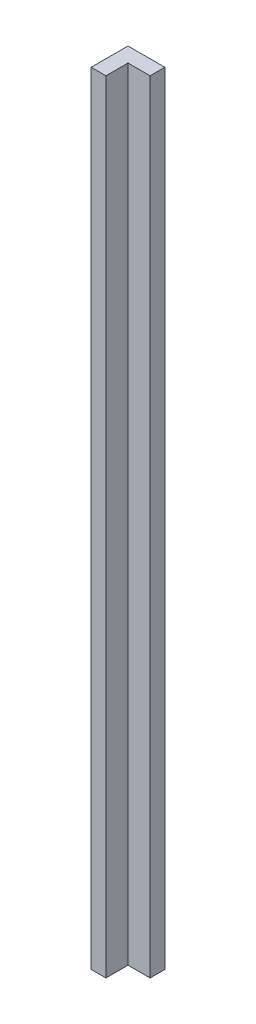
ISO-10303-21;
HEADER;
FILE_DESCRIPTION(('STEP AP214'),'2;1');
FILE_NAME('part.step','',(''),(''),'','','');
FILE_SCHEMA(('AUTOMOTIVE_DESIGN { 1 0 10303 214 1 1 1 1 }'));
ENDSEC;
DATA;
#1=APPLICATION_CONTEXT('core data for automotive mechanical design processes');
#2=APPLICATION_PROTOCOL_DEFINITION('international standard','automotive_design',2000,#1);
#3=PRODUCT_CONTEXT('',#1,'mechanical');
#4=PRODUCT('Part','Part','',(#3));
#5=PRODUCT_RELATED_PRODUCT_CATEGORY('part','',(#4));
#6=PRODUCT_DEFINITION_FORMATION('','',#4);
#7=PRODUCT_DEFINITION_CONTEXT('part definition',#1,'design');
#8=PRODUCT_DEFINITION('design','',#6,#7);
#9=PRODUCT_DEFINITION_SHAPE('','',#8);
#10=(LENGTH_UNIT() NAMED_UNIT(*) SI_UNIT(.MILLI.,.METRE.));
#11=(NAMED_UNIT(*) PLANE_ANGLE_UNIT() SI_UNIT($,.RADIAN.));
#12=(NAMED_UNIT(*) SI_UNIT($,.STERADIAN.) SOLID_ANGLE_UNIT());
#13=UNCERTAINTY_MEASURE_WITH_UNIT(LENGTH_MEASURE(1.E-05),#10,'distance_accuracy_value','');
#14=(GEOMETRIC_REPRESENTATION_CONTEXT(3) GLOBAL_UNCERTAINTY_ASSIGNED_CONTEXT((#13)) GLOBAL_UNIT_ASSIGNED_CONTEXT((#10,
#11,#12)) REPRESENTATION_CONTEXT('',''));
#15=CARTESIAN_POINT('',(0.,0.,0.));
#16=DIRECTION('',(0.,0.,1.));
#17=DIRECTION('',(1.,0.,0.));
#18=AXIS2_PLACEMENT_3D('',#15,#16,#17);
#19=CARTESIAN_POINT('',(-2.86150012018082,106.,3.29679835233847));
#20=DIRECTION('',(1.,0.,0.));
#21=DIRECTION('',(0.,0.,-1.));
#22=AXIS2_PLACEMENT_3D('',#19,#20,#21);
#23=PLANE('',#22);
#24=DIRECTION('',(0.,0.,1.));
#25=VECTOR('',#24,1.);
#26=CARTESIAN_POINT('',(-2.86150012018082,0.,3.29679835233847));
#27=LINE('',#26,#25);
#28=CARTESIAN_POINT('',(-2.86150012018082,0.,-1.70320164766153));
#29=VERTEX_POINT('',#28);
#30=CARTESIAN_POINT('',(-2.86150012018082,0.,3.29679835233847));
#31=VERTEX_POINT('',#30);
#32=EDGE_CURVE('E138',#29,#31,#27,.T.);
#33=ORIENTED_EDGE('',*,*,#32,.T.);
#34=DIRECTION('',(0.,-1.,0.));
#35=VECTOR('',#34,1.);
#36=CARTESIAN_POINT('',(-2.86150012018082,106.,3.29679835233847));
#37=LINE('',#36,#35);
#38=CARTESIAN_POINT('',(-2.86150012018082,106.,3.29679835233847));
#39=VERTEX_POINT('',#38);
#40=EDGE_CURVE('E54',#39,#31,#37,.T.);
#41=ORIENTED_EDGE('',*,*,#40,.F.);
#42=DIRECTION('',(0.,0.,1.));
#43=VECTOR('',#42,1.);
#44=CARTESIAN_POINT('',(-2.86150012018082,106.,3.29679835233847));
#45=LINE('',#44,#43);
#46=CARTESIAN_POINT('',(-2.86150012018082,106.,-1.70320164766153));
#47=VERTEX_POINT('',#46);
#48=EDGE_CURVE('E100',#47,#39,#45,.T.);
#49=ORIENTED_EDGE('',*,*,#48,.F.);
#50=DIRECTION('',(0.,-1.,0.));
#51=VECTOR('',#50,1.);
#52=CARTESIAN_POINT('',(-2.86150012018082,106.,-1.70320164766153));
#53=LINE('',#52,#51);
#54=EDGE_CURVE('E11',#47,#29,#53,.T.);
#55=ORIENTED_EDGE('',*,*,#54,.T.);
#56=EDGE_LOOP('',(#33,#41,#49,#55));
#57=FACE_BOUND('',#56,.T.);
#58=ADVANCED_FACE('F45',(#57),#23,.F.);
#59=CARTESIAN_POINT('',(-0.861500120180825,106.,3.29679835233847));
#60=DIRECTION('',(0.,0.,-1.));
#61=DIRECTION('',(-1.,0.,0.));
#62=AXIS2_PLACEMENT_3D('',#59,#60,#61);
#63=PLANE('',#62);
#64=DIRECTION('',(1.,0.,0.));
#65=VECTOR('',#64,1.);
#66=CARTESIAN_POINT('',(-0.861500120180825,0.,3.29679835233847));
#67=LINE('',#66,#65);
#68=CARTESIAN_POINT('',(-0.861500120180825,0.,3.29679835233847));
#69=VERTEX_POINT('',#68);
#70=EDGE_CURVE('E141',#31,#69,#67,.T.);
#71=ORIENTED_EDGE('',*,*,#70,.T.);
#72=DIRECTION('',(0.,-1.,0.));
#73=VECTOR('',#72,1.);
#74=CARTESIAN_POINT('',(-0.861500120180825,106.,3.29679835233847));
#75=LINE('',#74,#73);
#76=CARTESIAN_POINT('',(-0.861500120180825,106.,3.29679835233847));
#77=VERTEX_POINT('',#76);
#78=EDGE_CURVE('E125',#77,#69,#75,.T.);
#79=ORIENTED_EDGE('',*,*,#78,.F.);
#80=DIRECTION('',(1.,0.,0.));
#81=VECTOR('',#80,1.);
#82=CARTESIAN_POINT('',(-0.861500120180825,106.,3.29679835233847));
#83=LINE('',#82,#81);
#84=EDGE_CURVE('E114',#39,#77,#83,.T.);
#85=ORIENTED_EDGE('',*,*,#84,.F.);
#86=ORIENTED_EDGE('',*,*,#40,.T.);
#87=EDGE_LOOP('',(#71,#79,#85,#86));
#88=FACE_BOUND('',#87,.T.);
#89=ADVANCED_FACE('F162',(#88),#63,.F.);
#90=CARTESIAN_POINT('',(-0.861500120180825,106.,0.296798352338472));
#91=DIRECTION('',(-1.,0.,0.));
#92=DIRECTION('',(0.,0.,1.));
#93=AXIS2_PLACEMENT_3D('',#90,#91,#92);
#94=PLANE('',#93);
#95=DIRECTION('',(0.,0.,-1.));
#96=VECTOR('',#95,1.);
#97=CARTESIAN_POINT('',(-0.861500120180825,0.,0.296798352338472));
#98=LINE('',#97,#96);
#99=CARTESIAN_POINT('',(-0.861500120180825,0.,0.296798352338472));
#100=VERTEX_POINT('',#99);
#101=EDGE_CURVE('E123',#69,#100,#98,.T.);
#102=ORIENTED_EDGE('',*,*,#101,.T.);
#103=DIRECTION('',(0.,-1.,0.));
#104=VECTOR('',#103,1.);
#105=CARTESIAN_POINT('',(-0.861500120180825,106.,0.296798352338472));
#106=LINE('',#105,#104);
#107=CARTESIAN_POINT('',(-0.861500120180825,106.,0.296798352338472));
#108=VERTEX_POINT('',#107);
#109=EDGE_CURVE('E120',#108,#100,#106,.T.);
#110=ORIENTED_EDGE('',*,*,#109,.F.);
#111=DIRECTION('',(0.,0.,-1.));
#112=VECTOR('',#111,1.);
#113=CARTESIAN_POINT('',(-0.861500120180825,106.,0.296798352338472));
#114=LINE('',#113,#112);
#115=EDGE_CURVE('E108',#77,#108,#114,.T.);
#116=ORIENTED_EDGE('',*,*,#115,.F.);
#117=ORIENTED_EDGE('',*,*,#78,.T.);
#118=EDGE_LOOP('',(#102,#110,#116,#117));
#119=FACE_BOUND('',#118,.T.);
#120=ADVANCED_FACE('F121',(#119),#94,.F.);
#121=CARTESIAN_POINT('',(2.13849987981918,106.,0.296798352338471));
#122=DIRECTION('',(0.,0.,-1.));
#123=DIRECTION('',(-1.,0.,0.));
#124=AXIS2_PLACEMENT_3D('',#121,#122,#123);
#125=PLANE('',#124);
#126=DIRECTION('',(1.,0.,0.));
#127=VECTOR('',#126,1.);
#128=CARTESIAN_POINT('',(2.13849987981918,0.,0.296798352338471));
#129=LINE('',#128,#127);
#130=CARTESIAN_POINT('',(2.13849987981918,0.,0.296798352338471));
#131=VERTEX_POINT('',#130);
#132=EDGE_CURVE('E86',#100,#131,#129,.T.);
#133=ORIENTED_EDGE('',*,*,#132,.T.);
#134=DIRECTION('',(0.,-1.,0.));
#135=VECTOR('',#134,1.);
#136=CARTESIAN_POINT('',(2.13849987981918,106.,0.296798352338471));
#137=LINE('',#136,#135);
#138=CARTESIAN_POINT('',(2.13849987981918,106.,0.296798352338471));
#139=VERTEX_POINT('',#138);
#140=EDGE_CURVE('E126',#139,#131,#137,.T.);
#141=ORIENTED_EDGE('',*,*,#140,.F.);
#142=DIRECTION('',(1.,0.,0.));
#143=VECTOR('',#142,1.);
#144=CARTESIAN_POINT('',(2.13849987981918,106.,0.296798352338471));
#145=LINE('',#144,#143);
#146=EDGE_CURVE('E112',#108,#139,#145,.T.);
#147=ORIENTED_EDGE('',*,*,#146,.F.);
#148=ORIENTED_EDGE('',*,*,#109,.T.);
#149=EDGE_LOOP('',(#133,#141,#147,#148));
#150=FACE_BOUND('',#149,.T.);
#151=ADVANCED_FACE('F128',(#150),#125,.F.);
#152=CARTESIAN_POINT('',(2.13849987981918,106.,-1.70320164766153));
#153=DIRECTION('',(-1.,0.,0.));
#154=DIRECTION('',(0.,0.,1.));
#155=AXIS2_PLACEMENT_3D('',#152,#153,#154);
#156=PLANE('',#155);
#157=DIRECTION('',(0.,0.,-1.));
#158=VECTOR('',#157,1.);
#159=CARTESIAN_POINT('',(2.13849987981918,0.,-1.70320164766153));
#160=LINE('',#159,#158);
#161=CARTESIAN_POINT('',(2.13849987981918,0.,-1.70320164766153));
#162=VERTEX_POINT('',#161);
#163=EDGE_CURVE('E93',#131,#162,#160,.T.);
#164=ORIENTED_EDGE('',*,*,#163,.T.);
#165=DIRECTION('',(0.,-1.,0.));
#166=VECTOR('',#165,1.);
#167=CARTESIAN_POINT('',(2.13849987981918,106.,-1.70320164766153));
#168=LINE('',#167,#166);
#169=CARTESIAN_POINT('',(2.13849987981918,106.,-1.70320164766153));
#170=VERTEX_POINT('',#169);
#171=EDGE_CURVE('E134',#170,#162,#168,.T.);
#172=ORIENTED_EDGE('',*,*,#171,.F.);
#173=DIRECTION('',(0.,0.,-1.));
#174=VECTOR('',#173,1.);
#175=CARTESIAN_POINT('',(2.13849987981918,106.,-1.70320164766153));
#176=LINE('',#175,#174);
#177=EDGE_CURVE('E131',#139,#170,#176,.T.);
#178=ORIENTED_EDGE('',*,*,#177,.F.);
#179=ORIENTED_EDGE('',*,*,#140,.T.);
#180=EDGE_LOOP('',(#164,#172,#178,#179));
#181=FACE_BOUND('',#180,.T.);
#182=ADVANCED_FACE('F168',(#181),#156,.F.);
#183=CARTESIAN_POINT('',(-1.59284923665111,106.,-1.70320164766153));
#184=DIRECTION('',(0.,0.,1.));
#185=DIRECTION('',(1.,0.,0.));
#186=AXIS2_PLACEMENT_3D('',#183,#184,#185);
#187=PLANE('',#186);
#188=DIRECTION('',(-1.,0.,0.));
#189=VECTOR('',#188,1.);
#190=CARTESIAN_POINT('',(-1.59284923665111,0.,-1.70320164766153));
#191=LINE('',#190,#189);
#192=EDGE_CURVE('E150',#162,#29,#191,.T.);
#193=ORIENTED_EDGE('',*,*,#192,.T.);
#194=ORIENTED_EDGE('',*,*,#54,.F.);
#195=DIRECTION('',(-1.,0.,0.));
#196=VECTOR('',#195,1.);
#197=CARTESIAN_POINT('',(-2.86150012018082,106.,-1.70320164766153));
#198=LINE('',#197,#196);
#199=EDGE_CURVE('E62',#170,#47,#198,.T.);
#200=ORIENTED_EDGE('',*,*,#199,.F.);
#201=ORIENTED_EDGE('',*,*,#171,.T.);
#202=EDGE_LOOP('',(#193,#194,#200,#201));
#203=FACE_BOUND('',#202,.T.);
#204=ADVANCED_FACE('F167',(#203),#187,.F.);
#205=CARTESIAN_POINT('',(0.,106.,0.));
#206=DIRECTION('',(0.,-1.,0.));
#207=DIRECTION('',(0.,0.,-1.));
#208=AXIS2_PLACEMENT_3D('',#205,#206,#207);
#209=PLANE('',#208);
#210=ORIENTED_EDGE('',*,*,#199,.T.);
#211=ORIENTED_EDGE('',*,*,#48,.T.);
#212=ORIENTED_EDGE('',*,*,#84,.T.);
#213=ORIENTED_EDGE('',*,*,#115,.T.);
#214=ORIENTED_EDGE('',*,*,#146,.T.);
#215=ORIENTED_EDGE('',*,*,#177,.T.);
#216=EDGE_LOOP('',(#210,#211,#212,#213,#214,#215));
#217=FACE_BOUND('',#216,.T.);
#218=ADVANCED_FACE('F110',(#217),#209,.F.);
#219=CARTESIAN_POINT('',(0.,0.,0.));
#220=DIRECTION('',(0.,-1.,0.));
#221=DIRECTION('',(0.,0.,-1.));
#222=AXIS2_PLACEMENT_3D('',#219,#220,#221);
#223=PLANE('',#222);
#224=ORIENTED_EDGE('',*,*,#32,.F.);
#225=ORIENTED_EDGE('',*,*,#192,.F.);
#226=ORIENTED_EDGE('',*,*,#163,.F.);
#227=ORIENTED_EDGE('',*,*,#132,.F.);
#228=ORIENTED_EDGE('',*,*,#101,.F.);
#229=ORIENTED_EDGE('',*,*,#70,.F.);
#230=EDGE_LOOP('',(#224,#225,#226,#227,#228,#229));
#231=FACE_BOUND('',#230,.T.);
#232=ADVANCED_FACE('F165',(#231),#223,.T.);
#233=CLOSED_SHELL('',(#58,#89,#120,#151,#182,#204,#218,#232));
#234=MANIFOLD_SOLID_BREP('B2',#233);
#235=ADVANCED_BREP_SHAPE_REPRESENTATION('',(#18,#234),#14);
#236=SHAPE_DEFINITION_REPRESENTATION(#9,#235);
ENDSEC;
END-ISO-10303-21;
